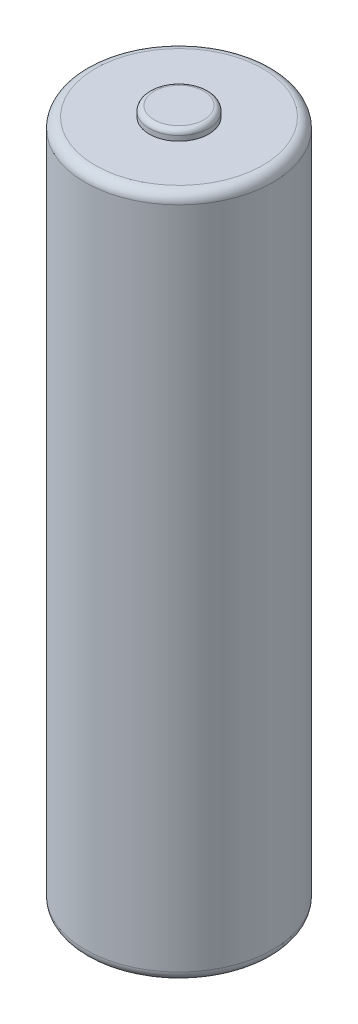
ISO-10303-21;
HEADER;
FILE_DESCRIPTION(('STEP AP214'),'2;1');
FILE_NAME('part.step','',(''),(''),'','','');
FILE_SCHEMA(('AUTOMOTIVE_DESIGN { 1 0 10303 214 1 1 1 1 }'));
ENDSEC;
DATA;
#1=APPLICATION_CONTEXT('core data for automotive mechanical design processes');
#2=APPLICATION_PROTOCOL_DEFINITION('international standard','automotive_design',2000,#1);
#3=PRODUCT_CONTEXT('',#1,'mechanical');
#4=PRODUCT('Part','Part','',(#3));
#5=PRODUCT_RELATED_PRODUCT_CATEGORY('part','',(#4));
#6=PRODUCT_DEFINITION_FORMATION('','',#4);
#7=PRODUCT_DEFINITION_CONTEXT('part definition',#1,'design');
#8=PRODUCT_DEFINITION('design','',#6,#7);
#9=PRODUCT_DEFINITION_SHAPE('','',#8);
#10=(LENGTH_UNIT() NAMED_UNIT(*) SI_UNIT(.MILLI.,.METRE.));
#11=(NAMED_UNIT(*) PLANE_ANGLE_UNIT() SI_UNIT($,.RADIAN.));
#12=(NAMED_UNIT(*) SI_UNIT($,.STERADIAN.) SOLID_ANGLE_UNIT());
#13=UNCERTAINTY_MEASURE_WITH_UNIT(LENGTH_MEASURE(1.E-05),#10,'distance_accuracy_value','');
#14=(GEOMETRIC_REPRESENTATION_CONTEXT(3) GLOBAL_UNCERTAINTY_ASSIGNED_CONTEXT((#13)) GLOBAL_UNIT_ASSIGNED_CONTEXT((#10,
#11,#12)) REPRESENTATION_CONTEXT('',''));
#15=CARTESIAN_POINT('',(0.,0.,0.));
#16=DIRECTION('',(0.,0.,1.));
#17=DIRECTION('',(1.,0.,0.));
#18=AXIS2_PLACEMENT_3D('',#15,#16,#17);
#19=CARTESIAN_POINT('',(0.,-35.,0.));
#20=DIRECTION('',(0.,1.,0.));
#21=DIRECTION('',(0.,0.,1.));
#22=AXIS2_PLACEMENT_3D('',#19,#20,#21);
#23=CYLINDRICAL_SURFACE('',#22,9.45);
#24=CARTESIAN_POINT('',(0.,-34.,0.));
#25=DIRECTION('',(0.,1.,0.));
#26=DIRECTION('',(0.,0.,1.));
#27=AXIS2_PLACEMENT_3D('',#24,#25,#26);
#28=CIRCLE('',#27,9.45);
#29=CARTESIAN_POINT('',(0.,-34.,9.45));
#30=VERTEX_POINT('',#29);
#31=EDGE_CURVE('E45',#30,#30,#28,.T.);
#32=ORIENTED_EDGE('',*,*,#31,.T.);
#33=EDGE_LOOP('',(#32));
#34=FACE_BOUND('',#33,.T.);
#35=CARTESIAN_POINT('',(0.,33.,0.));
#36=DIRECTION('',(0.,1.,0.));
#37=DIRECTION('',(0.,0.,1.));
#38=AXIS2_PLACEMENT_3D('',#35,#36,#37);
#39=CIRCLE('',#38,9.45);
#40=CARTESIAN_POINT('',(0.,33.,9.45));
#41=VERTEX_POINT('',#40);
#42=EDGE_CURVE('E49',#41,#41,#39,.F.);
#43=ORIENTED_EDGE('',*,*,#42,.T.);
#44=EDGE_LOOP('',(#43));
#45=FACE_BOUND('',#44,.T.);
#46=ADVANCED_FACE('F34',(#34,#45),#23,.T.);
#47=CARTESIAN_POINT('',(0.,-35.,0.));
#48=DIRECTION('',(0.,1.,0.));
#49=DIRECTION('',(0.,0.,1.));
#50=AXIS2_PLACEMENT_3D('',#47,#48,#49);
#51=PLANE('',#50);
#52=CARTESIAN_POINT('',(0.,-35.,0.));
#53=DIRECTION('',(0.,1.,0.));
#54=DIRECTION('',(0.,0.,1.));
#55=AXIS2_PLACEMENT_3D('',#52,#53,#54);
#56=CIRCLE('',#55,8.45);
#57=CARTESIAN_POINT('',(0.,-35.,8.45));
#58=VERTEX_POINT('',#57);
#59=EDGE_CURVE('E41',#58,#58,#56,.F.);
#60=ORIENTED_EDGE('',*,*,#59,.T.);
#61=EDGE_LOOP('',(#60));
#62=FACE_BOUND('',#61,.T.);
#63=ADVANCED_FACE('F68',(#62),#51,.F.);
#64=CARTESIAN_POINT('',(0.,34.,0.));
#65=DIRECTION('',(0.,1.,0.));
#66=DIRECTION('',(0.,0.,1.));
#67=AXIS2_PLACEMENT_3D('',#64,#65,#66);
#68=PLANE('',#67);
#69=CARTESIAN_POINT('',(0.,34.,0.));
#70=DIRECTION('',(0.,1.,0.));
#71=DIRECTION('',(0.,0.,1.));
#72=AXIS2_PLACEMENT_3D('',#69,#70,#71);
#73=CIRCLE('',#72,8.45);
#74=CARTESIAN_POINT('',(0.,34.,8.45));
#75=VERTEX_POINT('',#74);
#76=EDGE_CURVE('E10',#75,#75,#73,.T.);
#77=ORIENTED_EDGE('',*,*,#76,.T.);
#78=EDGE_LOOP('',(#77));
#79=FACE_BOUND('',#78,.T.);
#80=CARTESIAN_POINT('',(0.,34.,0.));
#81=DIRECTION('',(0.,1.,0.));
#82=DIRECTION('',(0.,0.,1.));
#83=AXIS2_PLACEMENT_3D('',#80,#81,#82);
#84=CIRCLE('',#83,3.);
#85=CARTESIAN_POINT('',(0.,34.,3.));
#86=VERTEX_POINT('',#85);
#87=EDGE_CURVE('E60',#86,#86,#84,.T.);
#88=ORIENTED_EDGE('',*,*,#87,.F.);
#89=EDGE_LOOP('',(#88));
#90=FACE_BOUND('',#89,.T.);
#91=ADVANCED_FACE('F66',(#79,#90),#68,.T.);
#92=CARTESIAN_POINT('',(0.,34.,0.));
#93=DIRECTION('',(0.,1.,0.));
#94=DIRECTION('',(0.,0.,1.));
#95=AXIS2_PLACEMENT_3D('',#92,#93,#94);
#96=CYLINDRICAL_SURFACE('',#95,3.);
#97=CARTESIAN_POINT('',(0.,34.5,0.));
#98=DIRECTION('',(0.,1.,0.));
#99=DIRECTION('',(0.,0.,1.));
#100=AXIS2_PLACEMENT_3D('',#97,#98,#99);
#101=CIRCLE('',#100,3.);
#102=CARTESIAN_POINT('',(0.,34.5,3.));
#103=VERTEX_POINT('',#102);
#104=EDGE_CURVE('E54',#103,#103,#101,.F.);
#105=ORIENTED_EDGE('',*,*,#104,.T.);
#106=EDGE_LOOP('',(#105));
#107=FACE_BOUND('',#106,.T.);
#108=ORIENTED_EDGE('',*,*,#87,.T.);
#109=EDGE_LOOP('',(#108));
#110=FACE_BOUND('',#109,.T.);
#111=ADVANCED_FACE('F64',(#107,#110),#96,.T.);
#112=CARTESIAN_POINT('',(0.,35.,0.));
#113=DIRECTION('',(0.,1.,0.));
#114=DIRECTION('',(0.,0.,1.));
#115=AXIS2_PLACEMENT_3D('',#112,#113,#114);
#116=PLANE('',#115);
#117=CARTESIAN_POINT('',(0.,35.,0.));
#118=DIRECTION('',(0.,1.,0.));
#119=DIRECTION('',(0.,0.,1.));
#120=AXIS2_PLACEMENT_3D('',#117,#118,#119);
#121=CIRCLE('',#120,2.5);
#122=CARTESIAN_POINT('',(0.,35.,2.5));
#123=VERTEX_POINT('',#122);
#124=EDGE_CURVE('E57',#123,#123,#121,.T.);
#125=ORIENTED_EDGE('',*,*,#124,.T.);
#126=EDGE_LOOP('',(#125));
#127=FACE_BOUND('',#126,.T.);
#128=ADVANCED_FACE('F74',(#127),#116,.T.);
#129=CARTESIAN_POINT('',(0.,34.5,0.));
#130=DIRECTION('',(0.,1.,0.));
#131=DIRECTION('',(0.,0.,1.));
#132=AXIS2_PLACEMENT_3D('',#129,#130,#131);
#133=TOROIDAL_SURFACE('',#132,2.5,0.5);
#134=ORIENTED_EDGE('',*,*,#104,.F.);
#135=EDGE_LOOP('',(#134));
#136=FACE_BOUND('',#135,.T.);
#137=ORIENTED_EDGE('',*,*,#124,.F.);
#138=EDGE_LOOP('',(#137));
#139=FACE_BOUND('',#138,.T.);
#140=ADVANCED_FACE('F86',(#136,#139),#133,.T.);
#141=CARTESIAN_POINT('',(0.,-34.,0.));
#142=DIRECTION('',(0.,1.,0.));
#143=DIRECTION('',(0.,0.,1.));
#144=AXIS2_PLACEMENT_3D('',#141,#142,#143);
#145=TOROIDAL_SURFACE('',#144,8.45,1.);
#146=ORIENTED_EDGE('',*,*,#59,.F.);
#147=EDGE_LOOP('',(#146));
#148=FACE_BOUND('',#147,.T.);
#149=ORIENTED_EDGE('',*,*,#31,.F.);
#150=EDGE_LOOP('',(#149));
#151=FACE_BOUND('',#150,.T.);
#152=ADVANCED_FACE('F88',(#148,#151),#145,.T.);
#153=CARTESIAN_POINT('',(0.,33.,0.));
#154=DIRECTION('',(0.,1.,0.));
#155=DIRECTION('',(0.,0.,1.));
#156=AXIS2_PLACEMENT_3D('',#153,#154,#155);
#157=TOROIDAL_SURFACE('',#156,8.45,1.);
#158=ORIENTED_EDGE('',*,*,#42,.F.);
#159=EDGE_LOOP('',(#158));
#160=FACE_BOUND('',#159,.T.);
#161=ORIENTED_EDGE('',*,*,#76,.F.);
#162=EDGE_LOOP('',(#161));
#163=FACE_BOUND('',#162,.T.);
#164=ADVANCED_FACE('F36',(#160,#163),#157,.T.);
#165=CLOSED_SHELL('',(#46,#63,#91,#111,#128,#140,#152,#164));
#166=MANIFOLD_SOLID_BREP('B2',#165);
#167=ADVANCED_BREP_SHAPE_REPRESENTATION('',(#18,#166),#14);
#168=SHAPE_DEFINITION_REPRESENTATION(#9,#167);
ENDSEC;
END-ISO-10303-21;
